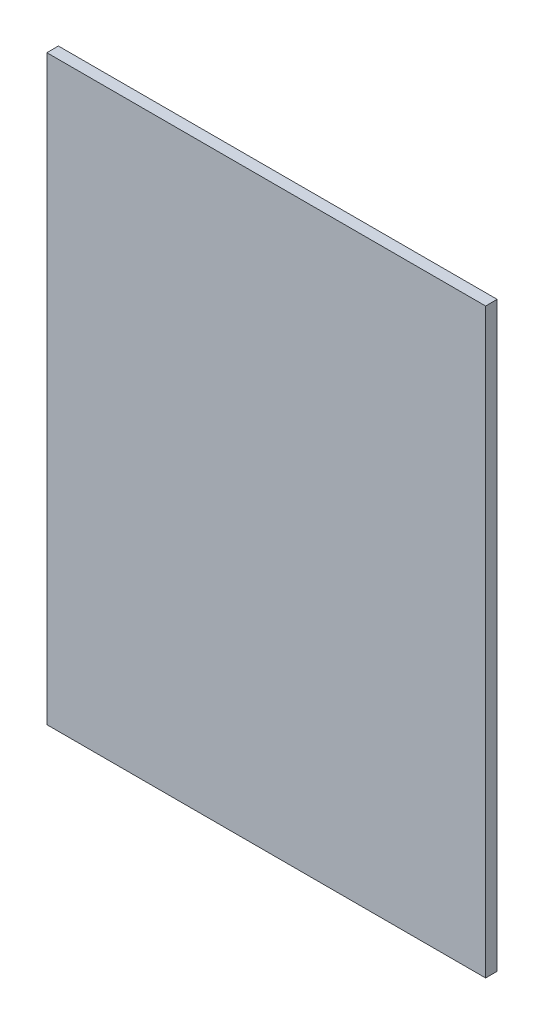
ISO-10303-21;
HEADER;
FILE_DESCRIPTION(('STEP AP214'),'2;1');
FILE_NAME('part.step','',(''),(''),'','','');
FILE_SCHEMA(('AUTOMOTIVE_DESIGN { 1 0 10303 214 1 1 1 1 }'));
ENDSEC;
DATA;
#1=APPLICATION_CONTEXT('core data for automotive mechanical design processes');
#2=APPLICATION_PROTOCOL_DEFINITION('international standard','automotive_design',2000,#1);
#3=PRODUCT_CONTEXT('',#1,'mechanical');
#4=PRODUCT('Part','Part','',(#3));
#5=PRODUCT_RELATED_PRODUCT_CATEGORY('part','',(#4));
#6=PRODUCT_DEFINITION_FORMATION('','',#4);
#7=PRODUCT_DEFINITION_CONTEXT('part definition',#1,'design');
#8=PRODUCT_DEFINITION('design','',#6,#7);
#9=PRODUCT_DEFINITION_SHAPE('','',#8);
#10=(LENGTH_UNIT() NAMED_UNIT(*) SI_UNIT(.MILLI.,.METRE.));
#11=(NAMED_UNIT(*) PLANE_ANGLE_UNIT() SI_UNIT($,.RADIAN.));
#12=(NAMED_UNIT(*) SI_UNIT($,.STERADIAN.) SOLID_ANGLE_UNIT());
#13=UNCERTAINTY_MEASURE_WITH_UNIT(LENGTH_MEASURE(1.E-05),#10,'distance_accuracy_value','');
#14=(GEOMETRIC_REPRESENTATION_CONTEXT(3) GLOBAL_UNCERTAINTY_ASSIGNED_CONTEXT((#13)) GLOBAL_UNIT_ASSIGNED_CONTEXT((#10,
#11,#12)) REPRESENTATION_CONTEXT('',''));
#15=CARTESIAN_POINT('',(0.,0.,0.));
#16=DIRECTION('',(0.,0.,1.));
#17=DIRECTION('',(1.,0.,0.));
#18=AXIS2_PLACEMENT_3D('',#15,#16,#17);
#19=CARTESIAN_POINT('',(130.,31.2,5.));
#20=DIRECTION('',(1.,0.,0.));
#21=DIRECTION('',(0.,0.,-1.));
#22=AXIS2_PLACEMENT_3D('',#19,#20,#21);
#23=PLANE('',#22);
#24=DIRECTION('',(0.,-1.,0.));
#25=VECTOR('',#24,1.);
#26=CARTESIAN_POINT('',(130.,31.2,0.));
#27=LINE('',#26,#25);
#28=CARTESIAN_POINT('',(130.,31.2,0.));
#29=VERTEX_POINT('',#28);
#30=CARTESIAN_POINT('',(130.,-220.8,0.));
#31=VERTEX_POINT('',#30);
#32=EDGE_CURVE('E97',#29,#31,#27,.T.);
#33=ORIENTED_EDGE('',*,*,#32,.T.);
#34=DIRECTION('',(0.,0.,-1.));
#35=VECTOR('',#34,1.);
#36=CARTESIAN_POINT('',(130.,-220.8,5.));
#37=LINE('',#36,#35);
#38=CARTESIAN_POINT('',(130.,-220.8,5.));
#39=VERTEX_POINT('',#38);
#40=EDGE_CURVE('E11',#39,#31,#37,.T.);
#41=ORIENTED_EDGE('',*,*,#40,.F.);
#42=DIRECTION('',(0.,-1.,0.));
#43=VECTOR('',#42,1.);
#44=CARTESIAN_POINT('',(130.,31.2,5.));
#45=LINE('',#44,#43);
#46=CARTESIAN_POINT('',(130.,31.2,5.));
#47=VERTEX_POINT('',#46);
#48=EDGE_CURVE('E85',#47,#39,#45,.T.);
#49=ORIENTED_EDGE('',*,*,#48,.F.);
#50=DIRECTION('',(0.,0.,-1.));
#51=VECTOR('',#50,1.);
#52=CARTESIAN_POINT('',(130.,31.2,5.));
#53=LINE('',#52,#51);
#54=EDGE_CURVE('E93',#47,#29,#53,.T.);
#55=ORIENTED_EDGE('',*,*,#54,.T.);
#56=EDGE_LOOP('',(#33,#41,#49,#55));
#57=FACE_BOUND('',#56,.T.);
#58=ADVANCED_FACE('F34',(#57),#23,.F.);
#59=CARTESIAN_POINT('',(130.,-220.8,5.));
#60=DIRECTION('',(0.,1.,0.));
#61=DIRECTION('',(0.,0.,1.));
#62=AXIS2_PLACEMENT_3D('',#59,#60,#61);
#63=PLANE('',#62);
#64=DIRECTION('',(1.,0.,0.));
#65=VECTOR('',#64,1.);
#66=CARTESIAN_POINT('',(130.,-220.8,0.));
#67=LINE('',#66,#65);
#68=CARTESIAN_POINT('',(320.,-220.8,0.));
#69=VERTEX_POINT('',#68);
#70=EDGE_CURVE('E89',#31,#69,#67,.T.);
#71=ORIENTED_EDGE('',*,*,#70,.T.);
#72=DIRECTION('',(0.,0.,-1.));
#73=VECTOR('',#72,1.);
#74=CARTESIAN_POINT('',(320.,-220.8,5.));
#75=LINE('',#74,#73);
#76=CARTESIAN_POINT('',(320.,-220.8,5.));
#77=VERTEX_POINT('',#76);
#78=EDGE_CURVE('E42',#77,#69,#75,.T.);
#79=ORIENTED_EDGE('',*,*,#78,.F.);
#80=DIRECTION('',(1.,0.,0.));
#81=VECTOR('',#80,1.);
#82=CARTESIAN_POINT('',(130.,-220.8,5.));
#83=LINE('',#82,#81);
#84=EDGE_CURVE('E80',#39,#77,#83,.T.);
#85=ORIENTED_EDGE('',*,*,#84,.F.);
#86=ORIENTED_EDGE('',*,*,#40,.T.);
#87=EDGE_LOOP('',(#71,#79,#85,#86));
#88=FACE_BOUND('',#87,.T.);
#89=ADVANCED_FACE('F88',(#88),#63,.F.);
#90=CARTESIAN_POINT('',(320.,31.2,5.));
#91=DIRECTION('',(-1.,0.,0.));
#92=DIRECTION('',(0.,-1.,0.));
#93=AXIS2_PLACEMENT_3D('',#90,#91,#92);
#94=PLANE('',#93);
#95=DIRECTION('',(0.,1.,0.));
#96=VECTOR('',#95,1.);
#97=CARTESIAN_POINT('',(320.,31.2,0.));
#98=LINE('',#97,#96);
#99=CARTESIAN_POINT('',(320.,31.2,0.));
#100=VERTEX_POINT('',#99);
#101=EDGE_CURVE('E67',#69,#100,#98,.T.);
#102=ORIENTED_EDGE('',*,*,#101,.T.);
#103=DIRECTION('',(0.,0.,-1.));
#104=VECTOR('',#103,1.);
#105=CARTESIAN_POINT('',(320.,31.2,5.));
#106=LINE('',#105,#104);
#107=CARTESIAN_POINT('',(320.,31.2,5.));
#108=VERTEX_POINT('',#107);
#109=EDGE_CURVE('E90',#108,#100,#106,.T.);
#110=ORIENTED_EDGE('',*,*,#109,.F.);
#111=DIRECTION('',(0.,1.,0.));
#112=VECTOR('',#111,1.);
#113=CARTESIAN_POINT('',(320.,31.2,5.));
#114=LINE('',#113,#112);
#115=EDGE_CURVE('E83',#77,#108,#114,.T.);
#116=ORIENTED_EDGE('',*,*,#115,.F.);
#117=ORIENTED_EDGE('',*,*,#78,.T.);
#118=EDGE_LOOP('',(#102,#110,#116,#117));
#119=FACE_BOUND('',#118,.T.);
#120=ADVANCED_FACE('F91',(#119),#94,.F.);
#121=CARTESIAN_POINT('',(130.,31.2,5.));
#122=DIRECTION('',(0.,-1.,0.));
#123=DIRECTION('',(1.,0.,0.));
#124=AXIS2_PLACEMENT_3D('',#121,#122,#123);
#125=PLANE('',#124);
#126=DIRECTION('',(-1.,0.,0.));
#127=VECTOR('',#126,1.);
#128=CARTESIAN_POINT('',(130.,31.2,0.));
#129=LINE('',#128,#127);
#130=EDGE_CURVE('E73',#100,#29,#129,.T.);
#131=ORIENTED_EDGE('',*,*,#130,.T.);
#132=ORIENTED_EDGE('',*,*,#54,.F.);
#133=DIRECTION('',(-1.,0.,0.));
#134=VECTOR('',#133,1.);
#135=CARTESIAN_POINT('',(130.,31.2,5.));
#136=LINE('',#135,#134);
#137=EDGE_CURVE('E50',#108,#47,#136,.T.);
#138=ORIENTED_EDGE('',*,*,#137,.F.);
#139=ORIENTED_EDGE('',*,*,#109,.T.);
#140=EDGE_LOOP('',(#131,#132,#138,#139));
#141=FACE_BOUND('',#140,.T.);
#142=ADVANCED_FACE('F104',(#141),#125,.F.);
#143=CARTESIAN_POINT('',(0.,0.,5.));
#144=DIRECTION('',(0.,0.,1.));
#145=DIRECTION('',(1.,0.,0.));
#146=AXIS2_PLACEMENT_3D('',#143,#144,#145);
#147=PLANE('',#146);
#148=ORIENTED_EDGE('',*,*,#48,.T.);
#149=ORIENTED_EDGE('',*,*,#84,.T.);
#150=ORIENTED_EDGE('',*,*,#115,.T.);
#151=ORIENTED_EDGE('',*,*,#137,.T.);
#152=EDGE_LOOP('',(#148,#149,#150,#151));
#153=FACE_BOUND('',#152,.T.);
#154=ADVANCED_FACE('F81',(#153),#147,.T.);
#155=CARTESIAN_POINT('',(0.,0.,0.));
#156=DIRECTION('',(0.,0.,1.));
#157=DIRECTION('',(1.,0.,0.));
#158=AXIS2_PLACEMENT_3D('',#155,#156,#157);
#159=PLANE('',#158);
#160=ORIENTED_EDGE('',*,*,#32,.F.);
#161=ORIENTED_EDGE('',*,*,#130,.F.);
#162=ORIENTED_EDGE('',*,*,#101,.F.);
#163=ORIENTED_EDGE('',*,*,#70,.F.);
#164=EDGE_LOOP('',(#160,#161,#162,#163));
#165=FACE_BOUND('',#164,.T.);
#166=ADVANCED_FACE('F107',(#165),#159,.F.);
#167=CLOSED_SHELL('',(#58,#89,#120,#142,#154,#166));
#168=MANIFOLD_SOLID_BREP('B2',#167);
#169=ADVANCED_BREP_SHAPE_REPRESENTATION('',(#18,#168),#14);
#170=SHAPE_DEFINITION_REPRESENTATION(#9,#169);
ENDSEC;
END-ISO-10303-21;
